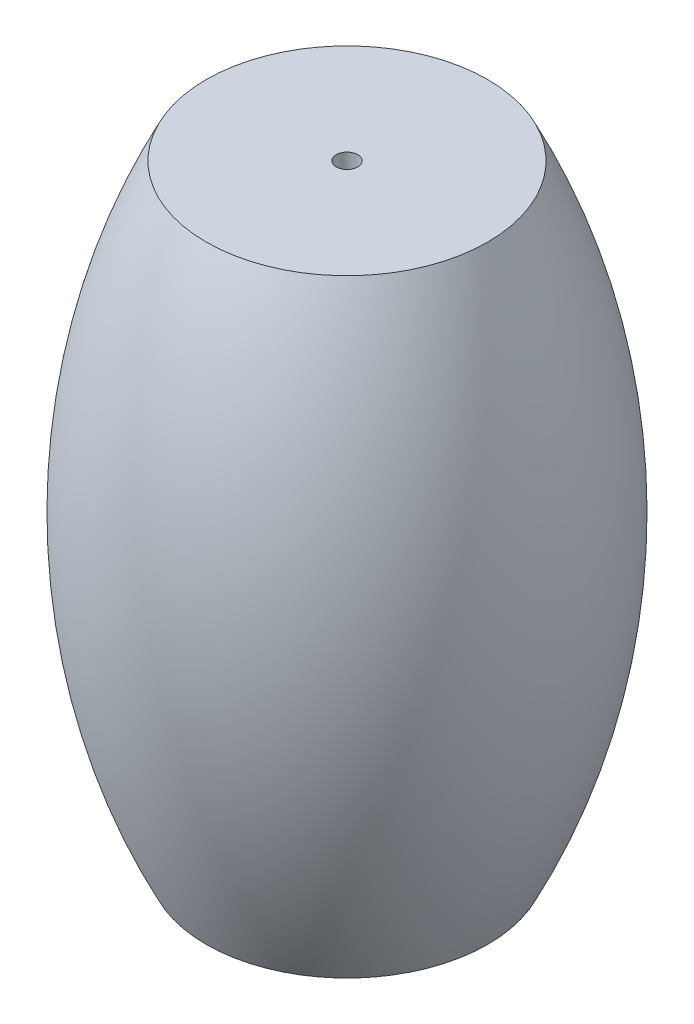
ISO-10303-21;
HEADER;
FILE_DESCRIPTION(('STEP AP214'),'2;1');
FILE_NAME('part.step','',(''),(''),'','','');
FILE_SCHEMA(('AUTOMOTIVE_DESIGN { 1 0 10303 214 1 1 1 1 }'));
ENDSEC;
DATA;
#1=APPLICATION_CONTEXT('core data for automotive mechanical design processes');
#2=APPLICATION_PROTOCOL_DEFINITION('international standard','automotive_design',2000,#1);
#3=PRODUCT_CONTEXT('',#1,'mechanical');
#4=PRODUCT('Part','Part','',(#3));
#5=PRODUCT_RELATED_PRODUCT_CATEGORY('part','',(#4));
#6=PRODUCT_DEFINITION_FORMATION('','',#4);
#7=PRODUCT_DEFINITION_CONTEXT('part definition',#1,'design');
#8=PRODUCT_DEFINITION('design','',#6,#7);
#9=PRODUCT_DEFINITION_SHAPE('','',#8);
#10=(LENGTH_UNIT() NAMED_UNIT(*) SI_UNIT(.MILLI.,.METRE.));
#11=(NAMED_UNIT(*) PLANE_ANGLE_UNIT() SI_UNIT($,.RADIAN.));
#12=(NAMED_UNIT(*) SI_UNIT($,.STERADIAN.) SOLID_ANGLE_UNIT());
#13=UNCERTAINTY_MEASURE_WITH_UNIT(LENGTH_MEASURE(1.E-05),#10,'distance_accuracy_value','');
#14=(GEOMETRIC_REPRESENTATION_CONTEXT(3) GLOBAL_UNCERTAINTY_ASSIGNED_CONTEXT((#13)) GLOBAL_UNIT_ASSIGNED_CONTEXT((#10,
#11,#12)) REPRESENTATION_CONTEXT('',''));
#15=CARTESIAN_POINT('',(0.,0.,0.));
#16=DIRECTION('',(0.,0.,1.));
#17=DIRECTION('',(1.,0.,0.));
#18=AXIS2_PLACEMENT_3D('',#15,#16,#17);
#19=CARTESIAN_POINT('',(0.,0.,0.));
#20=DIRECTION('',(0.,1.,0.));
#21=DIRECTION('',(0.,0.,1.));
#22=AXIS2_PLACEMENT_3D('',#19,#20,#21);
#23=PLANE('',#22);
#24=CARTESIAN_POINT('',(-0.5,0.,0.));
#25=DIRECTION('',(0.,-1.,0.));
#26=DIRECTION('',(0.,0.,-1.));
#27=AXIS2_PLACEMENT_3D('',#24,#25,#26);
#28=CIRCLE('',#27,0.5);
#29=CARTESIAN_POINT('',(-0.5,0.,-0.5));
#30=VERTEX_POINT('',#29);
#31=EDGE_CURVE('E62',#30,#30,#28,.T.);
#32=ORIENTED_EDGE('',*,*,#31,.F.);
#33=EDGE_LOOP('',(#32));
#34=FACE_BOUND('',#33,.T.);
#35=CARTESIAN_POINT('',(-0.5,0.,0.));
#36=DIRECTION('',(0.,-1.,0.));
#37=DIRECTION('',(0.,0.,-1.));
#38=AXIS2_PLACEMENT_3D('',#35,#36,#37);
#39=CIRCLE('',#38,6.59);
#40=CARTESIAN_POINT('',(-0.5,0.,-6.59));
#41=VERTEX_POINT('',#40);
#42=EDGE_CURVE('E10',#41,#41,#39,.T.);
#43=ORIENTED_EDGE('',*,*,#42,.T.);
#44=EDGE_LOOP('',(#43));
#45=FACE_BOUND('',#44,.T.);
#46=ADVANCED_FACE('F45',(#34,#45),#23,.F.);
#47=CARTESIAN_POINT('',(-0.5,14.2385,0.));
#48=DIRECTION('',(0.,-1.,0.));
#49=DIRECTION('',(0.,0.,-1.));
#50=AXIS2_PLACEMENT_3D('',#47,#48,#49);
#51=DEGENERATE_TOROIDAL_SURFACE('',#50,22.0677235270005,32.,.F.);
#52=CARTESIAN_POINT('',(-0.5,28.477,0.));
#53=DIRECTION('',(0.,-1.,0.));
#54=DIRECTION('',(0.,0.,-1.));
#55=AXIS2_PLACEMENT_3D('',#52,#53,#54);
#56=CIRCLE('',#55,6.59);
#57=CARTESIAN_POINT('',(-0.5,28.477,-6.59));
#58=VERTEX_POINT('',#57);
#59=EDGE_CURVE('E52',#58,#58,#56,.T.);
#60=ORIENTED_EDGE('',*,*,#59,.T.);
#61=EDGE_LOOP('',(#60));
#62=FACE_BOUND('',#61,.T.);
#63=ORIENTED_EDGE('',*,*,#42,.F.);
#64=EDGE_LOOP('',(#63));
#65=FACE_BOUND('',#64,.T.);
#66=ADVANCED_FACE('F72',(#62,#65),#51,.F.);
#67=CARTESIAN_POINT('',(0.,28.477,0.));
#68=DIRECTION('',(0.,-1.,0.));
#69=DIRECTION('',(0.,0.,-1.));
#70=AXIS2_PLACEMENT_3D('',#67,#68,#69);
#71=PLANE('',#70);
#72=ORIENTED_EDGE('',*,*,#59,.F.);
#73=EDGE_LOOP('',(#72));
#74=FACE_BOUND('',#73,.T.);
#75=CARTESIAN_POINT('',(-0.5,28.477,0.));
#76=DIRECTION('',(0.,-1.,0.));
#77=DIRECTION('',(0.,0.,-1.));
#78=AXIS2_PLACEMENT_3D('',#75,#76,#77);
#79=CIRCLE('',#78,0.5);
#80=CARTESIAN_POINT('',(-0.5,28.477,-0.5));
#81=VERTEX_POINT('',#80);
#82=EDGE_CURVE('E57',#81,#81,#79,.T.);
#83=ORIENTED_EDGE('',*,*,#82,.T.);
#84=EDGE_LOOP('',(#83));
#85=FACE_BOUND('',#84,.T.);
#86=ADVANCED_FACE('F76',(#74,#85),#71,.F.);
#87=CARTESIAN_POINT('',(-0.5,0.,0.));
#88=DIRECTION('',(0.,-1.,0.));
#89=DIRECTION('',(0.,0.,-1.));
#90=AXIS2_PLACEMENT_3D('',#87,#88,#89);
#91=CYLINDRICAL_SURFACE('',#90,0.5);
#92=ORIENTED_EDGE('',*,*,#82,.F.);
#93=EDGE_LOOP('',(#92));
#94=FACE_BOUND('',#93,.T.);
#95=ORIENTED_EDGE('',*,*,#31,.T.);
#96=EDGE_LOOP('',(#95));
#97=FACE_BOUND('',#96,.T.);
#98=ADVANCED_FACE('F69',(#94,#97),#91,.F.);
#99=CLOSED_SHELL('',(#46,#66,#86,#98));
#100=MANIFOLD_SOLID_BREP('B2',#99);
#101=ADVANCED_BREP_SHAPE_REPRESENTATION('',(#18,#100),#14);
#102=SHAPE_DEFINITION_REPRESENTATION(#9,#101);
ENDSEC;
END-ISO-10303-21;
